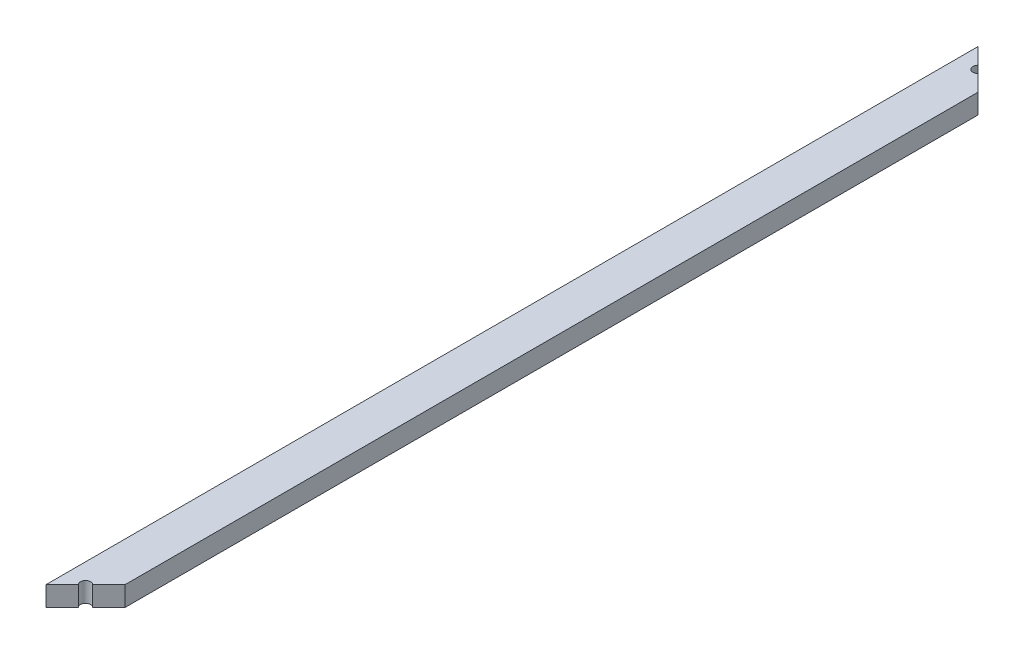
ISO-10303-21;
HEADER;
FILE_DESCRIPTION(('STEP AP214'),'2;1');
FILE_NAME('part.step','',(''),(''),'','','');
FILE_SCHEMA(('AUTOMOTIVE_DESIGN { 1 0 10303 214 1 1 1 1 }'));
ENDSEC;
DATA;
#1=APPLICATION_CONTEXT('core data for automotive mechanical design processes');
#2=APPLICATION_PROTOCOL_DEFINITION('international standard','automotive_design',2000,#1);
#3=PRODUCT_CONTEXT('',#1,'mechanical');
#4=PRODUCT('Part','Part','',(#3));
#5=PRODUCT_RELATED_PRODUCT_CATEGORY('part','',(#4));
#6=PRODUCT_DEFINITION_FORMATION('','',#4);
#7=PRODUCT_DEFINITION_CONTEXT('part definition',#1,'design');
#8=PRODUCT_DEFINITION('design','',#6,#7);
#9=PRODUCT_DEFINITION_SHAPE('','',#8);
#10=(LENGTH_UNIT() NAMED_UNIT(*) SI_UNIT(.MILLI.,.METRE.));
#11=(NAMED_UNIT(*) PLANE_ANGLE_UNIT() SI_UNIT($,.RADIAN.));
#12=(NAMED_UNIT(*) SI_UNIT($,.STERADIAN.) SOLID_ANGLE_UNIT());
#13=UNCERTAINTY_MEASURE_WITH_UNIT(LENGTH_MEASURE(1.E-05),#10,'distance_accuracy_value','');
#14=(GEOMETRIC_REPRESENTATION_CONTEXT(3) GLOBAL_UNCERTAINTY_ASSIGNED_CONTEXT((#13)) GLOBAL_UNIT_ASSIGNED_CONTEXT((#10,
#11,#12)) REPRESENTATION_CONTEXT('',''));
#15=CARTESIAN_POINT('',(0.,0.,0.));
#16=DIRECTION('',(0.,0.,1.));
#17=DIRECTION('',(1.,0.,0.));
#18=AXIS2_PLACEMENT_3D('',#15,#16,#17);
#19=CARTESIAN_POINT('',(0.,0.,0.));
#20=DIRECTION('',(-0.707106781186544,0.,0.707106781186551));
#21=DIRECTION('',(0.707106781186551,0.,0.707106781186544));
#22=AXIS2_PLACEMENT_3D('',#19,#20,#21);
#23=PLANE('',#22);
#24=DIRECTION('',(0.707106781186551,0.,0.707106781186544));
#25=VECTOR('',#24,1.);
#26=CARTESIAN_POINT('',(0.,0.,0.));
#27=LINE('',#26,#25);
#28=CARTESIAN_POINT('',(8.27279220613579,0.,8.2727922061357));
#29=VERTEX_POINT('',#28);
#30=CARTESIAN_POINT('',(14.,0.,13.9999999999998));
#31=VERTEX_POINT('',#30);
#32=EDGE_CURVE('E109',#29,#31,#27,.T.);
#33=ORIENTED_EDGE('',*,*,#32,.F.);
#34=DIRECTION('',(0.,1.,0.));
#35=VECTOR('',#34,1.);
#36=CARTESIAN_POINT('',(8.27279220613579,0.,8.2727922061357));
#37=LINE('',#36,#35);
#38=CARTESIAN_POINT('',(8.27279220613579,7.,8.2727922061357));
#39=VERTEX_POINT('',#38);
#40=EDGE_CURVE('E96',#29,#39,#37,.T.);
#41=ORIENTED_EDGE('',*,*,#40,.T.);
#42=DIRECTION('',(0.707106781186551,0.,0.707106781186544));
#43=VECTOR('',#42,1.);
#44=CARTESIAN_POINT('',(0.,7.,0.));
#45=LINE('',#44,#43);
#46=CARTESIAN_POINT('',(14.,7.,13.9999999999998));
#47=VERTEX_POINT('',#46);
#48=EDGE_CURVE('E119',#39,#47,#45,.T.);
#49=ORIENTED_EDGE('',*,*,#48,.T.);
#50=DIRECTION('',(0.,1.,0.));
#51=VECTOR('',#50,1.);
#52=CARTESIAN_POINT('',(14.,0.,13.9999999999998));
#53=LINE('',#52,#51);
#54=EDGE_CURVE('E115',#31,#47,#53,.T.);
#55=ORIENTED_EDGE('',*,*,#54,.F.);
#56=EDGE_LOOP('',(#33,#41,#49,#55));
#57=FACE_BOUND('',#56,.T.);
#58=ADVANCED_FACE('F33',(#57),#23,.F.);
#59=CARTESIAN_POINT('',(0.,0.,330.));
#60=DIRECTION('',(-0.707106781186543,0.,-0.707106781186552));
#61=DIRECTION('',(-0.707106781186552,0.,0.707106781186543));
#62=AXIS2_PLACEMENT_3D('',#59,#60,#61);
#63=PLANE('',#62);
#64=DIRECTION('',(-0.707106781186552,0.,0.707106781186543));
#65=VECTOR('',#64,1.);
#66=CARTESIAN_POINT('',(0.,0.,330.));
#67=LINE('',#66,#65);
#68=CARTESIAN_POINT('',(5.72720779386424,0.,324.272792206136));
#69=VERTEX_POINT('',#68);
#70=CARTESIAN_POINT('',(0.,0.,330.));
#71=VERTEX_POINT('',#70);
#72=EDGE_CURVE('E145',#69,#71,#67,.T.);
#73=ORIENTED_EDGE('',*,*,#72,.F.);
#74=DIRECTION('',(0.,1.,0.));
#75=VECTOR('',#74,1.);
#76=CARTESIAN_POINT('',(5.72720779386424,0.,324.272792206136));
#77=LINE('',#76,#75);
#78=CARTESIAN_POINT('',(5.72720779386424,7.,324.272792206136));
#79=VERTEX_POINT('',#78);
#80=EDGE_CURVE('E149',#69,#79,#77,.T.);
#81=ORIENTED_EDGE('',*,*,#80,.T.);
#82=DIRECTION('',(-0.707106781186552,0.,0.707106781186543));
#83=VECTOR('',#82,1.);
#84=CARTESIAN_POINT('',(0.,7.,330.));
#85=LINE('',#84,#83);
#86=CARTESIAN_POINT('',(0.,7.,330.));
#87=VERTEX_POINT('',#86);
#88=EDGE_CURVE('E152',#79,#87,#85,.T.);
#89=ORIENTED_EDGE('',*,*,#88,.T.);
#90=DIRECTION('',(0.,-1.,0.));
#91=VECTOR('',#90,1.);
#92=CARTESIAN_POINT('',(0.,0.,330.));
#93=LINE('',#92,#91);
#94=EDGE_CURVE('E127',#87,#71,#93,.T.);
#95=ORIENTED_EDGE('',*,*,#94,.T.);
#96=EDGE_LOOP('',(#73,#81,#89,#95));
#97=FACE_BOUND('',#96,.T.);
#98=ADVANCED_FACE('F174',(#97),#63,.F.);
#99=CARTESIAN_POINT('',(0.,0.,330.));
#100=DIRECTION('',(1.,0.,0.));
#101=DIRECTION('',(0.,0.,-1.));
#102=AXIS2_PLACEMENT_3D('',#99,#100,#101);
#103=PLANE('',#102);
#104=DIRECTION('',(0.,-1.,0.));
#105=VECTOR('',#104,1.);
#106=CARTESIAN_POINT('',(0.,0.,0.));
#107=LINE('',#106,#105);
#108=CARTESIAN_POINT('',(0.,7.,0.));
#109=VERTEX_POINT('',#108);
#110=CARTESIAN_POINT('',(0.,0.,0.));
#111=VERTEX_POINT('',#110);
#112=EDGE_CURVE('E126',#109,#111,#107,.T.);
#113=ORIENTED_EDGE('',*,*,#112,.T.);
#114=DIRECTION('',(0.,0.,-1.));
#115=VECTOR('',#114,1.);
#116=CARTESIAN_POINT('',(0.,0.,330.));
#117=LINE('',#116,#115);
#118=EDGE_CURVE('E11',#71,#111,#117,.T.);
#119=ORIENTED_EDGE('',*,*,#118,.F.);
#120=ORIENTED_EDGE('',*,*,#94,.F.);
#121=DIRECTION('',(0.,0.,-1.));
#122=VECTOR('',#121,1.);
#123=CARTESIAN_POINT('',(0.,7.,330.));
#124=LINE('',#123,#122);
#125=EDGE_CURVE('E130',#87,#109,#124,.T.);
#126=ORIENTED_EDGE('',*,*,#125,.T.);
#127=EDGE_LOOP('',(#113,#119,#120,#126));
#128=FACE_BOUND('',#127,.T.);
#129=ADVANCED_FACE('F35',(#128),#103,.F.);
#130=CARTESIAN_POINT('',(0.,0.,330.));
#131=DIRECTION('',(0.,1.,0.));
#132=DIRECTION('',(0.,0.,1.));
#133=AXIS2_PLACEMENT_3D('',#130,#131,#132);
#134=PLANE('',#133);
#135=CARTESIAN_POINT('',(5.72720779386418,0.,5.72720779386412));
#136=VERTEX_POINT('',#135);
#137=EDGE_CURVE('E111',#111,#136,#27,.T.);
#138=ORIENTED_EDGE('',*,*,#137,.T.);
#139=CARTESIAN_POINT('',(7.,0.,6.99999999999992));
#140=DIRECTION('',(0.,1.,0.));
#141=DIRECTION('',(0.,0.,1.));
#142=AXIS2_PLACEMENT_3D('',#139,#140,#141);
#143=CIRCLE('',#142,1.8);
#144=EDGE_CURVE('E48',#136,#29,#143,.T.);
#145=ORIENTED_EDGE('',*,*,#144,.T.);
#146=ORIENTED_EDGE('',*,*,#32,.T.);
#147=DIRECTION('',(0.,0.,-1.));
#148=VECTOR('',#147,1.);
#149=CARTESIAN_POINT('',(14.,0.,330.));
#150=LINE('',#149,#148);
#151=CARTESIAN_POINT('',(14.,0.,316.));
#152=VERTEX_POINT('',#151);
#153=EDGE_CURVE('E41',#152,#31,#150,.T.);
#154=ORIENTED_EDGE('',*,*,#153,.F.);
#155=CARTESIAN_POINT('',(8.27279220613582,0.,321.727207793864));
#156=VERTEX_POINT('',#155);
#157=EDGE_CURVE('E142',#152,#156,#67,.T.);
#158=ORIENTED_EDGE('',*,*,#157,.T.);
#159=CARTESIAN_POINT('',(7.00000000000003,0.,323.));
#160=DIRECTION('',(0.,1.,0.));
#161=DIRECTION('',(0.,0.,-1.));
#162=AXIS2_PLACEMENT_3D('',#159,#160,#161);
#163=CIRCLE('',#162,1.79999999999997);
#164=EDGE_CURVE('E56',#156,#69,#163,.T.);
#165=ORIENTED_EDGE('',*,*,#164,.T.);
#166=ORIENTED_EDGE('',*,*,#72,.T.);
#167=ORIENTED_EDGE('',*,*,#118,.T.);
#168=EDGE_LOOP('',(#138,#145,#146,#154,#158,#165,#166,#167));
#169=FACE_BOUND('',#168,.T.);
#170=ADVANCED_FACE('F107',(#169),#134,.F.);
#171=CARTESIAN_POINT('',(14.,0.,330.));
#172=DIRECTION('',(-1.,0.,0.));
#173=DIRECTION('',(0.,0.,1.));
#174=AXIS2_PLACEMENT_3D('',#171,#172,#173);
#175=PLANE('',#174);
#176=DIRECTION('',(0.,0.,-1.));
#177=VECTOR('',#176,1.);
#178=CARTESIAN_POINT('',(14.,7.,330.));
#179=LINE('',#178,#177);
#180=CARTESIAN_POINT('',(14.,7.,316.));
#181=VERTEX_POINT('',#180);
#182=EDGE_CURVE('E135',#181,#47,#179,.T.);
#183=ORIENTED_EDGE('',*,*,#182,.F.);
#184=DIRECTION('',(0.,1.,0.));
#185=VECTOR('',#184,1.);
#186=CARTESIAN_POINT('',(14.,0.,316.));
#187=LINE('',#186,#185);
#188=EDGE_CURVE('E122',#152,#181,#187,.T.);
#189=ORIENTED_EDGE('',*,*,#188,.F.);
#190=ORIENTED_EDGE('',*,*,#153,.T.);
#191=ORIENTED_EDGE('',*,*,#54,.T.);
#192=EDGE_LOOP('',(#183,#189,#190,#191));
#193=FACE_BOUND('',#192,.T.);
#194=ADVANCED_FACE('F140',(#193),#175,.F.);
#195=CARTESIAN_POINT('',(0.,7.,330.));
#196=DIRECTION('',(0.,-1.,0.));
#197=DIRECTION('',(0.,0.,-1.));
#198=AXIS2_PLACEMENT_3D('',#195,#196,#197);
#199=PLANE('',#198);
#200=ORIENTED_EDGE('',*,*,#48,.F.);
#201=CARTESIAN_POINT('',(7.,7.,6.99999999999992));
#202=DIRECTION('',(0.,1.,0.));
#203=DIRECTION('',(0.,0.,1.));
#204=AXIS2_PLACEMENT_3D('',#201,#202,#203);
#205=CIRCLE('',#204,1.8);
#206=CARTESIAN_POINT('',(5.72720779386424,7.,5.72720779386412));
#207=VERTEX_POINT('',#206);
#208=EDGE_CURVE('E99',#207,#39,#205,.T.);
#209=ORIENTED_EDGE('',*,*,#208,.F.);
#210=EDGE_CURVE('E116',#109,#207,#45,.T.);
#211=ORIENTED_EDGE('',*,*,#210,.F.);
#212=ORIENTED_EDGE('',*,*,#125,.F.);
#213=ORIENTED_EDGE('',*,*,#88,.F.);
#214=CARTESIAN_POINT('',(7.00000000000003,7.,323.));
#215=DIRECTION('',(0.,1.,0.));
#216=DIRECTION('',(0.,0.,-1.));
#217=AXIS2_PLACEMENT_3D('',#214,#215,#216);
#218=CIRCLE('',#217,1.79999999999997);
#219=CARTESIAN_POINT('',(8.27279220613582,7.,321.727207793864));
#220=VERTEX_POINT('',#219);
#221=EDGE_CURVE('E161',#220,#79,#218,.T.);
#222=ORIENTED_EDGE('',*,*,#221,.F.);
#223=EDGE_CURVE('E147',#181,#220,#85,.T.);
#224=ORIENTED_EDGE('',*,*,#223,.F.);
#225=ORIENTED_EDGE('',*,*,#182,.T.);
#226=EDGE_LOOP('',(#200,#209,#211,#212,#213,#222,#224,#225));
#227=FACE_BOUND('',#226,.T.);
#228=ADVANCED_FACE('F168',(#227),#199,.F.);
#229=ORIENTED_EDGE('',*,*,#210,.T.);
#230=DIRECTION('',(0.,1.,0.));
#231=VECTOR('',#230,1.);
#232=CARTESIAN_POINT('',(5.72720779386424,0.,5.72720779386412));
#233=LINE('',#232,#231);
#234=EDGE_CURVE('E103',#136,#207,#233,.T.);
#235=ORIENTED_EDGE('',*,*,#234,.F.);
#236=ORIENTED_EDGE('',*,*,#137,.F.);
#237=ORIENTED_EDGE('',*,*,#112,.F.);
#238=EDGE_LOOP('',(#229,#235,#236,#237));
#239=FACE_BOUND('',#238,.T.);
#240=ADVANCED_FACE('F169',(#239),#23,.F.);
#241=ORIENTED_EDGE('',*,*,#223,.T.);
#242=DIRECTION('',(0.,1.,0.));
#243=VECTOR('',#242,1.);
#244=CARTESIAN_POINT('',(8.27279220613582,0.,321.727207793864));
#245=LINE('',#244,#243);
#246=EDGE_CURVE('E154',#156,#220,#245,.T.);
#247=ORIENTED_EDGE('',*,*,#246,.F.);
#248=ORIENTED_EDGE('',*,*,#157,.F.);
#249=ORIENTED_EDGE('',*,*,#188,.T.);
#250=EDGE_LOOP('',(#241,#247,#248,#249));
#251=FACE_BOUND('',#250,.T.);
#252=ADVANCED_FACE('F177',(#251),#63,.F.);
#253=CARTESIAN_POINT('',(7.00000000000003,0.,323.));
#254=DIRECTION('',(0.,1.,0.));
#255=DIRECTION('',(0.,0.,1.));
#256=AXIS2_PLACEMENT_3D('',#253,#254,#255);
#257=CYLINDRICAL_SURFACE('',#256,1.79999999999997);
#258=ORIENTED_EDGE('',*,*,#221,.T.);
#259=ORIENTED_EDGE('',*,*,#80,.F.);
#260=ORIENTED_EDGE('',*,*,#164,.F.);
#261=ORIENTED_EDGE('',*,*,#246,.T.);
#262=EDGE_LOOP('',(#258,#259,#260,#261));
#263=FACE_BOUND('',#262,.T.);
#264=ADVANCED_FACE('F173',(#263),#257,.F.);
#265=CARTESIAN_POINT('',(7.,0.,6.99999999999992));
#266=DIRECTION('',(0.,1.,0.));
#267=DIRECTION('',(0.,0.,1.));
#268=AXIS2_PLACEMENT_3D('',#265,#266,#267);
#269=CYLINDRICAL_SURFACE('',#268,1.8);
#270=ORIENTED_EDGE('',*,*,#208,.T.);
#271=ORIENTED_EDGE('',*,*,#40,.F.);
#272=ORIENTED_EDGE('',*,*,#144,.F.);
#273=ORIENTED_EDGE('',*,*,#234,.T.);
#274=EDGE_LOOP('',(#270,#271,#272,#273));
#275=FACE_BOUND('',#274,.T.);
#276=ADVANCED_FACE('F97',(#275),#269,.F.);
#277=CLOSED_SHELL('',(#58,#98,#129,#170,#194,#228,#240,#252,#264,#276));
#278=MANIFOLD_SOLID_BREP('B2',#277);
#279=ADVANCED_BREP_SHAPE_REPRESENTATION('',(#18,#278),#14);
#280=SHAPE_DEFINITION_REPRESENTATION(#9,#279);
ENDSEC;
END-ISO-10303-21;
